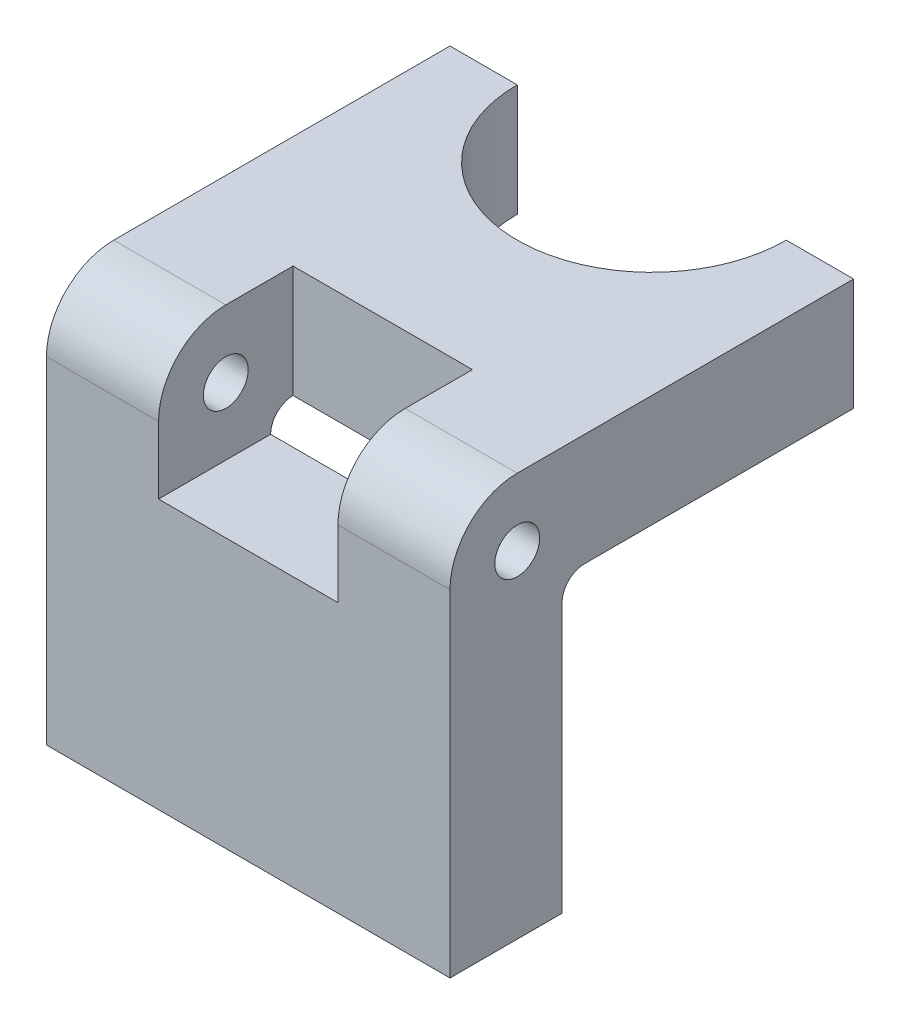
ISO-10303-21;
HEADER;
FILE_DESCRIPTION(('STEP AP214'),'2;1');
FILE_NAME('part.step','',(''),(''),'','','');
FILE_SCHEMA(('AUTOMOTIVE_DESIGN { 1 0 10303 214 1 1 1 1 }'));
ENDSEC;
DATA;
#1=APPLICATION_CONTEXT('core data for automotive mechanical design processes');
#2=APPLICATION_PROTOCOL_DEFINITION('international standard','automotive_design',2000,#1);
#3=PRODUCT_CONTEXT('',#1,'mechanical');
#4=PRODUCT('Part','Part','',(#3));
#5=PRODUCT_RELATED_PRODUCT_CATEGORY('part','',(#4));
#6=PRODUCT_DEFINITION_FORMATION('','',#4);
#7=PRODUCT_DEFINITION_CONTEXT('part definition',#1,'design');
#8=PRODUCT_DEFINITION('design','',#6,#7);
#9=PRODUCT_DEFINITION_SHAPE('','',#8);
#10=(LENGTH_UNIT() NAMED_UNIT(*) SI_UNIT(.MILLI.,.METRE.));
#11=(NAMED_UNIT(*) PLANE_ANGLE_UNIT() SI_UNIT($,.RADIAN.));
#12=(NAMED_UNIT(*) SI_UNIT($,.STERADIAN.) SOLID_ANGLE_UNIT());
#13=UNCERTAINTY_MEASURE_WITH_UNIT(LENGTH_MEASURE(1.E-05),#10,'distance_accuracy_value','');
#14=(GEOMETRIC_REPRESENTATION_CONTEXT(3) GLOBAL_UNCERTAINTY_ASSIGNED_CONTEXT((#13)) GLOBAL_UNIT_ASSIGNED_CONTEXT((#10,
#11,#12)) REPRESENTATION_CONTEXT('',''));
#15=CARTESIAN_POINT('',(0.,0.,0.));
#16=DIRECTION('',(0.,0.,1.));
#17=DIRECTION('',(1.,0.,0.));
#18=AXIS2_PLACEMENT_3D('',#15,#16,#17);
#19=CARTESIAN_POINT('',(57.15,13.7165047081966,0.));
#20=DIRECTION('',(0.,1.,0.));
#21=DIRECTION('',(0.,0.,1.));
#22=AXIS2_PLACEMENT_3D('',#19,#20,#21);
#23=PLANE('',#22);
#24=DIRECTION('',(-1.,0.,0.));
#25=VECTOR('',#24,1.);
#26=CARTESIAN_POINT('',(57.15,13.7165047081966,1.91264037979371));
#27=LINE('',#26,#25);
#28=CARTESIAN_POINT('',(15.875,13.7165047081966,1.91264037979371));
#29=VERTEX_POINT('',#28);
#30=CARTESIAN_POINT('',(0.,13.7165047081966,1.91264037979371));
#31=VERTEX_POINT('',#30);
#32=EDGE_CURVE('E50',#29,#31,#27,.T.);
#33=ORIENTED_EDGE('',*,*,#32,.F.);
#34=DIRECTION('',(0.,0.,-1.));
#35=VECTOR('',#34,1.);
#36=CARTESIAN_POINT('',(15.875,13.7165047081966,0.));
#37=LINE('',#36,#35);
#38=CARTESIAN_POINT('',(15.875,13.7165047081966,-7.61235962020625));
#39=VERTEX_POINT('',#38);
#40=EDGE_CURVE('E155',#29,#39,#37,.T.);
#41=ORIENTED_EDGE('',*,*,#40,.T.);
#42=DIRECTION('',(1.,0.,0.));
#43=VECTOR('',#42,1.);
#44=CARTESIAN_POINT('',(15.875,13.7165047081966,-7.61235962020625));
#45=LINE('',#44,#43);
#46=CARTESIAN_POINT('',(41.275,13.7165047081966,-7.61235962020625));
#47=VERTEX_POINT('',#46);
#48=EDGE_CURVE('E290',#39,#47,#45,.T.);
#49=ORIENTED_EDGE('',*,*,#48,.T.);
#50=DIRECTION('',(0.,0.,-1.));
#51=VECTOR('',#50,1.);
#52=CARTESIAN_POINT('',(41.275,13.7165047081966,0.));
#53=LINE('',#52,#51);
#54=CARTESIAN_POINT('',(41.275,13.7165047081966,1.91264037979371));
#55=VERTEX_POINT('',#54);
#56=EDGE_CURVE('E316',#55,#47,#53,.T.);
#57=ORIENTED_EDGE('',*,*,#56,.F.);
#58=CARTESIAN_POINT('',(57.15,13.7165047081966,1.91264037979371));
#59=VERTEX_POINT('',#58);
#60=EDGE_CURVE('E11',#59,#55,#27,.T.);
#61=ORIENTED_EDGE('',*,*,#60,.F.);
#62=DIRECTION('',(0.,0.,-1.));
#63=VECTOR('',#62,1.);
#64=CARTESIAN_POINT('',(57.15,13.7165047081966,0.));
#65=LINE('',#64,#63);
#66=CARTESIAN_POINT('',(57.15,13.7165047081966,-45.7123596202062));
#67=VERTEX_POINT('',#66);
#68=EDGE_CURVE('E216',#59,#67,#65,.T.);
#69=ORIENTED_EDGE('',*,*,#68,.T.);
#70=DIRECTION('',(-1.,0.,0.));
#71=VECTOR('',#70,1.);
#72=CARTESIAN_POINT('',(57.15,13.7165047081966,-45.7123596202062));
#73=LINE('',#72,#71);
#74=CARTESIAN_POINT('',(47.625,13.7165047081966,-45.7123596202062));
#75=VERTEX_POINT('',#74);
#76=EDGE_CURVE('E207',#67,#75,#73,.T.);
#77=ORIENTED_EDGE('',*,*,#76,.T.);
#78=CARTESIAN_POINT('',(28.575,13.7165047081966,-45.7123596202062));
#79=DIRECTION('',(0.,1.,0.));
#80=DIRECTION('',(0.,0.,1.));
#81=AXIS2_PLACEMENT_3D('',#78,#79,#80);
#82=CIRCLE('',#81,19.05);
#83=CARTESIAN_POINT('',(9.52499999999999,13.7165047081966,-45.7123596202062));
#84=VERTEX_POINT('',#83);
#85=EDGE_CURVE('E279',#84,#75,#82,.T.);
#86=ORIENTED_EDGE('',*,*,#85,.F.);
#87=CARTESIAN_POINT('',(0.,13.7165047081966,-45.7123596202062));
#88=VERTEX_POINT('',#87);
#89=EDGE_CURVE('E211',#84,#88,#73,.T.);
#90=ORIENTED_EDGE('',*,*,#89,.T.);
#91=DIRECTION('',(0.,0.,-1.));
#92=VECTOR('',#91,1.);
#93=CARTESIAN_POINT('',(0.,13.7165047081966,0.));
#94=LINE('',#93,#92);
#95=EDGE_CURVE('E181',#31,#88,#94,.T.);
#96=ORIENTED_EDGE('',*,*,#95,.F.);
#97=EDGE_LOOP('',(#33,#41,#49,#57,#61,#69,#77,#86,#90,#96));
#98=FACE_BOUND('',#97,.T.);
#99=ADVANCED_FACE('F42',(#98),#23,.T.);
#100=CARTESIAN_POINT('',(57.15,4.19150470819657,1.91264037979378));
#101=DIRECTION('',(-1.,0.,0.));
#102=DIRECTION('',(0.,0.,1.));
#103=AXIS2_PLACEMENT_3D('',#100,#101,#102);
#104=CYLINDRICAL_SURFACE('',#103,9.525);
#105=CARTESIAN_POINT('',(15.875,4.19150470819657,1.91264037979378));
#106=DIRECTION('',(1.,0.,0.));
#107=DIRECTION('',(0.,0.,-1.));
#108=AXIS2_PLACEMENT_3D('',#105,#106,#107);
#109=CIRCLE('',#108,9.525);
#110=CARTESIAN_POINT('',(15.875,4.1915047081965,11.4376403797938));
#111=VERTEX_POINT('',#110);
#112=EDGE_CURVE('E159',#29,#111,#109,.T.);
#113=ORIENTED_EDGE('',*,*,#112,.F.);
#114=ORIENTED_EDGE('',*,*,#32,.T.);
#115=CARTESIAN_POINT('',(0.,4.19150470819657,1.91264037979378));
#116=DIRECTION('',(1.,0.,0.));
#117=DIRECTION('',(0.,0.,-1.));
#118=AXIS2_PLACEMENT_3D('',#115,#116,#117);
#119=CIRCLE('',#118,9.525);
#120=CARTESIAN_POINT('',(0.,4.1915047081965,11.4376403797938));
#121=VERTEX_POINT('',#120);
#122=EDGE_CURVE('E231',#31,#121,#119,.T.);
#123=ORIENTED_EDGE('',*,*,#122,.T.);
#124=DIRECTION('',(-1.,0.,0.));
#125=VECTOR('',#124,1.);
#126=CARTESIAN_POINT('',(57.15,4.1915047081965,11.4376403797938));
#127=LINE('',#126,#125);
#128=EDGE_CURVE('E175',#111,#121,#127,.T.);
#129=ORIENTED_EDGE('',*,*,#128,.F.);
#130=EDGE_LOOP('',(#113,#114,#123,#129));
#131=FACE_BOUND('',#130,.T.);
#132=ADVANCED_FACE('F172',(#131),#104,.T.);
#133=CARTESIAN_POINT('',(57.15,0.,11.4376403797938));
#134=DIRECTION('',(0.,0.,-1.));
#135=DIRECTION('',(0.,1.,0.));
#136=AXIS2_PLACEMENT_3D('',#133,#134,#135);
#137=PLANE('',#136);
#138=DIRECTION('',(0.,1.,0.));
#139=VECTOR('',#138,1.);
#140=CARTESIAN_POINT('',(15.875,0.,11.4376403797938));
#141=LINE('',#140,#139);
#142=CARTESIAN_POINT('',(15.875,-5.33349529180345,11.4376403797938));
#143=VERTEX_POINT('',#142);
#144=EDGE_CURVE('E177',#143,#111,#141,.T.);
#145=ORIENTED_EDGE('',*,*,#144,.T.);
#146=ORIENTED_EDGE('',*,*,#128,.T.);
#147=DIRECTION('',(0.,-1.,0.));
#148=VECTOR('',#147,1.);
#149=CARTESIAN_POINT('',(0.,0.,11.4376403797938));
#150=LINE('',#149,#148);
#151=CARTESIAN_POINT('',(0.,-43.4334952918034,11.4376403797938));
#152=VERTEX_POINT('',#151);
#153=EDGE_CURVE('E228',#121,#152,#150,.T.);
#154=ORIENTED_EDGE('',*,*,#153,.T.);
#155=DIRECTION('',(-1.,0.,0.));
#156=VECTOR('',#155,1.);
#157=CARTESIAN_POINT('',(57.15,-43.4334952918034,11.4376403797938));
#158=LINE('',#157,#156);
#159=CARTESIAN_POINT('',(57.15,-43.4334952918034,11.4376403797938));
#160=VERTEX_POINT('',#159);
#161=EDGE_CURVE('E193',#160,#152,#158,.T.);
#162=ORIENTED_EDGE('',*,*,#161,.F.);
#163=DIRECTION('',(0.,-1.,0.));
#164=VECTOR('',#163,1.);
#165=CARTESIAN_POINT('',(57.15,0.,11.4376403797938));
#166=LINE('',#165,#164);
#167=CARTESIAN_POINT('',(57.15,4.1915047081965,11.4376403797938));
#168=VERTEX_POINT('',#167);
#169=EDGE_CURVE('E251',#168,#160,#166,.T.);
#170=ORIENTED_EDGE('',*,*,#169,.F.);
#171=CARTESIAN_POINT('',(41.275,4.1915047081965,11.4376403797938));
#172=VERTEX_POINT('',#171);
#173=EDGE_CURVE('E183',#168,#172,#127,.T.);
#174=ORIENTED_EDGE('',*,*,#173,.T.);
#175=DIRECTION('',(0.,1.,0.));
#176=VECTOR('',#175,1.);
#177=CARTESIAN_POINT('',(41.275,0.,11.4376403797938));
#178=LINE('',#177,#176);
#179=CARTESIAN_POINT('',(41.275,-5.33349529180345,11.4376403797938));
#180=VERTEX_POINT('',#179);
#181=EDGE_CURVE('E309',#180,#172,#178,.T.);
#182=ORIENTED_EDGE('',*,*,#181,.F.);
#183=DIRECTION('',(1.,0.,0.));
#184=VECTOR('',#183,1.);
#185=CARTESIAN_POINT('',(15.875,-5.33349529180345,11.4376403797938));
#186=LINE('',#185,#184);
#187=EDGE_CURVE('E57',#143,#180,#186,.T.);
#188=ORIENTED_EDGE('',*,*,#187,.F.);
#189=EDGE_LOOP('',(#145,#146,#154,#162,#170,#174,#182,#188));
#190=FACE_BOUND('',#189,.T.);
#191=ADVANCED_FACE('F367',(#190),#137,.F.);
#192=CARTESIAN_POINT('',(57.15,-5.33349529180343,-7.61235962020622));
#193=DIRECTION('',(-1.,0.,0.));
#194=DIRECTION('',(0.,0.,1.));
#195=AXIS2_PLACEMENT_3D('',#192,#193,#194);
#196=CYLINDRICAL_SURFACE('',#195,3.175);
#197=DIRECTION('',(-1.,0.,0.));
#198=VECTOR('',#197,1.);
#199=CARTESIAN_POINT('',(57.15,-2.15849529180343,-7.61235962020625));
#200=LINE('',#199,#198);
#201=CARTESIAN_POINT('',(15.875,-2.15849529180343,-7.61235962020625));
#202=VERTEX_POINT('',#201);
#203=CARTESIAN_POINT('',(0.,-2.15849529180343,-7.61235962020625));
#204=VERTEX_POINT('',#203);
#205=EDGE_CURVE('E264',#202,#204,#200,.T.);
#206=ORIENTED_EDGE('',*,*,#205,.F.);
#207=CARTESIAN_POINT('',(15.875,-5.33349529180343,-7.61235962020622));
#208=DIRECTION('',(1.,0.,0.));
#209=DIRECTION('',(0.,0.,-1.));
#210=AXIS2_PLACEMENT_3D('',#207,#208,#209);
#211=CIRCLE('',#210,3.175);
#212=CARTESIAN_POINT('',(15.875,-5.33349529180345,-4.43735962020622));
#213=VERTEX_POINT('',#212);
#214=EDGE_CURVE('E323',#202,#213,#211,.T.);
#215=ORIENTED_EDGE('',*,*,#214,.T.);
#216=DIRECTION('',(-1.,0.,0.));
#217=VECTOR('',#216,1.);
#218=CARTESIAN_POINT('',(57.15,-5.33349529180345,-4.43735962020622));
#219=LINE('',#218,#217);
#220=CARTESIAN_POINT('',(0.,-5.33349529180345,-4.43735962020622));
#221=VERTEX_POINT('',#220);
#222=EDGE_CURVE('E265',#213,#221,#219,.T.);
#223=ORIENTED_EDGE('',*,*,#222,.T.);
#224=CARTESIAN_POINT('',(0.,-5.33349529180343,-7.61235962020622));
#225=DIRECTION('',(1.,0.,0.));
#226=DIRECTION('',(0.,0.,-1.));
#227=AXIS2_PLACEMENT_3D('',#224,#225,#226);
#228=CIRCLE('',#227,3.175);
#229=EDGE_CURVE('E269',#204,#221,#228,.T.);
#230=ORIENTED_EDGE('',*,*,#229,.F.);
#231=EDGE_LOOP('',(#206,#215,#223,#230));
#232=FACE_BOUND('',#231,.T.);
#233=ADVANCED_FACE('F372',(#232),#196,.F.);
#234=CARTESIAN_POINT('',(57.15,0.,-45.7123596202062));
#235=DIRECTION('',(0.,0.,-1.));
#236=DIRECTION('',(0.,1.,0.));
#237=AXIS2_PLACEMENT_3D('',#234,#235,#236);
#238=PLANE('',#237);
#239=DIRECTION('',(0.,1.,0.));
#240=VECTOR('',#239,1.);
#241=CARTESIAN_POINT('',(9.52499999999999,-43.4344952918034,-45.7123596202062));
#242=LINE('',#241,#240);
#243=CARTESIAN_POINT('',(9.52499999999999,-2.15849529180343,-45.7123596202062));
#244=VERTEX_POINT('',#243);
#245=EDGE_CURVE('E282',#84,#244,#242,.F.);
#246=ORIENTED_EDGE('',*,*,#245,.T.);
#247=DIRECTION('',(-1.,0.,0.));
#248=VECTOR('',#247,1.);
#249=CARTESIAN_POINT('',(57.15,-2.15849529180343,-45.7123596202062));
#250=LINE('',#249,#248);
#251=CARTESIAN_POINT('',(0.,-2.15849529180343,-45.7123596202062));
#252=VERTEX_POINT('',#251);
#253=EDGE_CURVE('E206',#244,#252,#250,.T.);
#254=ORIENTED_EDGE('',*,*,#253,.T.);
#255=DIRECTION('',(0.,-1.,0.));
#256=VECTOR('',#255,1.);
#257=CARTESIAN_POINT('',(0.,0.,-45.7123596202062));
#258=LINE('',#257,#256);
#259=EDGE_CURVE('E212',#88,#252,#258,.T.);
#260=ORIENTED_EDGE('',*,*,#259,.F.);
#261=ORIENTED_EDGE('',*,*,#89,.F.);
#262=EDGE_LOOP('',(#246,#254,#260,#261));
#263=FACE_BOUND('',#262,.T.);
#264=ADVANCED_FACE('F458',(#263),#238,.T.);
#265=CARTESIAN_POINT('',(57.15,0.,-4.43735962020622));
#266=DIRECTION('',(0.,0.,-1.));
#267=DIRECTION('',(0.,1.,0.));
#268=AXIS2_PLACEMENT_3D('',#265,#266,#267);
#269=PLANE('',#268);
#270=DIRECTION('',(0.,-1.,0.));
#271=VECTOR('',#270,1.);
#272=CARTESIAN_POINT('',(0.,0.,-4.43735962020622));
#273=LINE('',#272,#271);
#274=CARTESIAN_POINT('',(0.,-43.4334952918034,-4.43735962020623));
#275=VERTEX_POINT('',#274);
#276=EDGE_CURVE('E221',#221,#275,#273,.T.);
#277=ORIENTED_EDGE('',*,*,#276,.F.);
#278=ORIENTED_EDGE('',*,*,#222,.F.);
#279=DIRECTION('',(1.,0.,0.));
#280=VECTOR('',#279,1.);
#281=CARTESIAN_POINT('',(15.875,-5.33349529180345,-4.43735962020622));
#282=LINE('',#281,#280);
#283=CARTESIAN_POINT('',(41.275,-5.33349529180345,-4.43735962020622));
#284=VERTEX_POINT('',#283);
#285=EDGE_CURVE('E293',#213,#284,#282,.T.);
#286=ORIENTED_EDGE('',*,*,#285,.T.);
#287=CARTESIAN_POINT('',(57.15,-5.33349529180345,-4.43735962020622));
#288=VERTEX_POINT('',#287);
#289=EDGE_CURVE('E260',#288,#284,#219,.T.);
#290=ORIENTED_EDGE('',*,*,#289,.F.);
#291=DIRECTION('',(0.,-1.,0.));
#292=VECTOR('',#291,1.);
#293=CARTESIAN_POINT('',(57.15,0.,-4.43735962020622));
#294=LINE('',#293,#292);
#295=CARTESIAN_POINT('',(57.15,-43.4334952918034,-4.43735962020623));
#296=VERTEX_POINT('',#295);
#297=EDGE_CURVE('E244',#288,#296,#294,.T.);
#298=ORIENTED_EDGE('',*,*,#297,.T.);
#299=DIRECTION('',(-1.,0.,0.));
#300=VECTOR('',#299,1.);
#301=CARTESIAN_POINT('',(57.15,-43.4334952918034,-4.43735962020623));
#302=LINE('',#301,#300);
#303=EDGE_CURVE('E198',#296,#275,#302,.T.);
#304=ORIENTED_EDGE('',*,*,#303,.T.);
#305=EDGE_LOOP('',(#277,#278,#286,#290,#298,#304));
#306=FACE_BOUND('',#305,.T.);
#307=ADVANCED_FACE('F385',(#306),#269,.T.);
#308=CARTESIAN_POINT('',(57.15,-2.15849529180343,0.));
#309=DIRECTION('',(0.,1.,0.));
#310=DIRECTION('',(0.,0.,1.));
#311=AXIS2_PLACEMENT_3D('',#308,#309,#310);
#312=PLANE('',#311);
#313=ORIENTED_EDGE('',*,*,#253,.F.);
#314=CARTESIAN_POINT('',(28.575,-2.15849529180343,-45.7123596202062));
#315=DIRECTION('',(0.,1.,0.));
#316=DIRECTION('',(0.,0.,1.));
#317=AXIS2_PLACEMENT_3D('',#314,#315,#316);
#318=CIRCLE('',#317,19.05);
#319=CARTESIAN_POINT('',(47.625,-2.15849529180343,-45.7123596202062));
#320=VERTEX_POINT('',#319);
#321=EDGE_CURVE('E274',#320,#244,#318,.F.);
#322=ORIENTED_EDGE('',*,*,#321,.F.);
#323=CARTESIAN_POINT('',(57.15,-2.15849529180343,-45.7123596202062));
#324=VERTEX_POINT('',#323);
#325=EDGE_CURVE('E202',#324,#320,#250,.T.);
#326=ORIENTED_EDGE('',*,*,#325,.F.);
#327=DIRECTION('',(0.,0.,-1.));
#328=VECTOR('',#327,1.);
#329=CARTESIAN_POINT('',(57.15,-2.15849529180343,0.));
#330=LINE('',#329,#328);
#331=CARTESIAN_POINT('',(57.15,-2.15849529180343,-7.61235962020625));
#332=VERTEX_POINT('',#331);
#333=EDGE_CURVE('E241',#332,#324,#330,.T.);
#334=ORIENTED_EDGE('',*,*,#333,.F.);
#335=CARTESIAN_POINT('',(41.275,-2.15849529180343,-7.61235962020625));
#336=VERTEX_POINT('',#335);
#337=EDGE_CURVE('E236',#332,#336,#200,.T.);
#338=ORIENTED_EDGE('',*,*,#337,.T.);
#339=DIRECTION('',(1.,0.,0.));
#340=VECTOR('',#339,1.);
#341=CARTESIAN_POINT('',(15.875,-2.15849529180343,-7.61235962020625));
#342=LINE('',#341,#340);
#343=EDGE_CURVE('E65',#202,#336,#342,.T.);
#344=ORIENTED_EDGE('',*,*,#343,.F.);
#345=ORIENTED_EDGE('',*,*,#205,.T.);
#346=DIRECTION('',(0.,0.,-1.));
#347=VECTOR('',#346,1.);
#348=CARTESIAN_POINT('',(0.,-2.15849529180343,0.));
#349=LINE('',#348,#347);
#350=EDGE_CURVE('E217',#204,#252,#349,.T.);
#351=ORIENTED_EDGE('',*,*,#350,.T.);
#352=EDGE_LOOP('',(#313,#322,#326,#334,#338,#344,#345,#351));
#353=FACE_BOUND('',#352,.T.);
#354=ADVANCED_FACE('F376',(#353),#312,.F.);
#355=ORIENTED_EDGE('',*,*,#60,.T.);
#356=CARTESIAN_POINT('',(41.275,4.19150470819657,1.91264037979378));
#357=DIRECTION('',(1.,0.,0.));
#358=DIRECTION('',(0.,0.,-1.));
#359=AXIS2_PLACEMENT_3D('',#356,#357,#358);
#360=CIRCLE('',#359,9.525);
#361=EDGE_CURVE('E312',#55,#172,#360,.T.);
#362=ORIENTED_EDGE('',*,*,#361,.T.);
#363=ORIENTED_EDGE('',*,*,#173,.F.);
#364=CARTESIAN_POINT('',(57.15,4.19150470819657,1.91264037979378));
#365=DIRECTION('',(1.,0.,0.));
#366=DIRECTION('',(0.,0.,-1.));
#367=AXIS2_PLACEMENT_3D('',#364,#365,#366);
#368=CIRCLE('',#367,9.525);
#369=EDGE_CURVE('E254',#59,#168,#368,.T.);
#370=ORIENTED_EDGE('',*,*,#369,.F.);
#371=EDGE_LOOP('',(#355,#362,#363,#370));
#372=FACE_BOUND('',#371,.T.);
#373=ADVANCED_FACE('F368',(#372),#104,.T.);
#374=CARTESIAN_POINT('',(57.15,-43.4334952918034,0.));
#375=DIRECTION('',(0.,1.,0.));
#376=DIRECTION('',(0.,0.,1.));
#377=AXIS2_PLACEMENT_3D('',#374,#375,#376);
#378=PLANE('',#377);
#379=DIRECTION('',(0.,0.,-1.));
#380=VECTOR('',#379,1.);
#381=CARTESIAN_POINT('',(0.,-43.4334952918034,0.));
#382=LINE('',#381,#380);
#383=EDGE_CURVE('E224',#152,#275,#382,.T.);
#384=ORIENTED_EDGE('',*,*,#383,.T.);
#385=ORIENTED_EDGE('',*,*,#303,.F.);
#386=DIRECTION('',(0.,0.,-1.));
#387=VECTOR('',#386,1.);
#388=CARTESIAN_POINT('',(57.15,-43.4334952918034,0.));
#389=LINE('',#388,#387);
#390=EDGE_CURVE('E247',#160,#296,#389,.T.);
#391=ORIENTED_EDGE('',*,*,#390,.F.);
#392=ORIENTED_EDGE('',*,*,#161,.T.);
#393=EDGE_LOOP('',(#384,#385,#391,#392));
#394=FACE_BOUND('',#393,.T.);
#395=ADVANCED_FACE('F375',(#394),#378,.F.);
#396=DIRECTION('',(0.,1.,0.));
#397=VECTOR('',#396,1.);
#398=CARTESIAN_POINT('',(47.625,-43.4344952918034,-45.7123596202062));
#399=LINE('',#398,#397);
#400=EDGE_CURVE('E286',#320,#75,#399,.T.);
#401=ORIENTED_EDGE('',*,*,#400,.T.);
#402=ORIENTED_EDGE('',*,*,#76,.F.);
#403=DIRECTION('',(0.,-1.,0.));
#404=VECTOR('',#403,1.);
#405=CARTESIAN_POINT('',(57.15,0.,-45.7123596202062));
#406=LINE('',#405,#404);
#407=EDGE_CURVE('E237',#67,#324,#406,.T.);
#408=ORIENTED_EDGE('',*,*,#407,.T.);
#409=ORIENTED_EDGE('',*,*,#325,.T.);
#410=EDGE_LOOP('',(#401,#402,#408,#409));
#411=FACE_BOUND('',#410,.T.);
#412=ADVANCED_FACE('F382',(#411),#238,.T.);
#413=CARTESIAN_POINT('',(57.15,0.,0.));
#414=DIRECTION('',(1.,0.,0.));
#415=DIRECTION('',(0.,0.,-1.));
#416=AXIS2_PLACEMENT_3D('',#413,#414,#415);
#417=PLANE('',#416);
#418=CARTESIAN_POINT('',(57.15,4.19150470819657,1.91264037979378));
#419=DIRECTION('',(1.,0.,0.));
#420=DIRECTION('',(0.,0.,-1.));
#421=AXIS2_PLACEMENT_3D('',#418,#419,#420);
#422=CIRCLE('',#421,3.175);
#423=CARTESIAN_POINT('',(57.15,4.19150470819657,-1.26235962020622));
#424=VERTEX_POINT('',#423);
#425=EDGE_CURVE('E340',#424,#424,#422,.T.);
#426=ORIENTED_EDGE('',*,*,#425,.F.);
#427=EDGE_LOOP('',(#426));
#428=FACE_BOUND('',#427,.T.);
#429=CARTESIAN_POINT('',(57.15,-5.33349529180343,-7.61235962020622));
#430=DIRECTION('',(1.,0.,0.));
#431=DIRECTION('',(0.,0.,-1.));
#432=AXIS2_PLACEMENT_3D('',#429,#430,#431);
#433=CIRCLE('',#432,3.175);
#434=EDGE_CURVE('E273',#332,#288,#433,.T.);
#435=ORIENTED_EDGE('',*,*,#434,.F.);
#436=ORIENTED_EDGE('',*,*,#333,.T.);
#437=ORIENTED_EDGE('',*,*,#407,.F.);
#438=ORIENTED_EDGE('',*,*,#68,.F.);
#439=ORIENTED_EDGE('',*,*,#369,.T.);
#440=ORIENTED_EDGE('',*,*,#169,.T.);
#441=ORIENTED_EDGE('',*,*,#390,.T.);
#442=ORIENTED_EDGE('',*,*,#297,.F.);
#443=EDGE_LOOP('',(#435,#436,#437,#438,#439,#440,#441,#442));
#444=FACE_BOUND('',#443,.T.);
#445=ADVANCED_FACE('F470',(#428,#444),#417,.T.);
#446=CARTESIAN_POINT('',(0.,0.,0.));
#447=DIRECTION('',(1.,0.,0.));
#448=DIRECTION('',(0.,0.,-1.));
#449=AXIS2_PLACEMENT_3D('',#446,#447,#448);
#450=PLANE('',#449);
#451=CARTESIAN_POINT('',(0.,4.19150470819657,1.91264037979378));
#452=DIRECTION('',(1.,0.,0.));
#453=DIRECTION('',(0.,0.,-1.));
#454=AXIS2_PLACEMENT_3D('',#451,#452,#453);
#455=CIRCLE('',#454,3.175);
#456=CARTESIAN_POINT('',(0.,4.19150470819657,-1.26235962020622));
#457=VERTEX_POINT('',#456);
#458=EDGE_CURVE('E339',#457,#457,#455,.T.);
#459=ORIENTED_EDGE('',*,*,#458,.T.);
#460=EDGE_LOOP('',(#459));
#461=FACE_BOUND('',#460,.T.);
#462=ORIENTED_EDGE('',*,*,#350,.F.);
#463=ORIENTED_EDGE('',*,*,#229,.T.);
#464=ORIENTED_EDGE('',*,*,#276,.T.);
#465=ORIENTED_EDGE('',*,*,#383,.F.);
#466=ORIENTED_EDGE('',*,*,#153,.F.);
#467=ORIENTED_EDGE('',*,*,#122,.F.);
#468=ORIENTED_EDGE('',*,*,#95,.T.);
#469=ORIENTED_EDGE('',*,*,#259,.T.);
#470=EDGE_LOOP('',(#462,#463,#464,#465,#466,#467,#468,#469));
#471=FACE_BOUND('',#470,.T.);
#472=ADVANCED_FACE('F349',(#461,#471),#450,.F.);
#473=CARTESIAN_POINT('',(41.275,-5.33349529180343,-7.61235962020622));
#474=DIRECTION('',(1.,0.,0.));
#475=DIRECTION('',(0.,0.,-1.));
#476=AXIS2_PLACEMENT_3D('',#473,#474,#475);
#477=CIRCLE('',#476,3.175);
#478=EDGE_CURVE('E303',#336,#284,#477,.T.);
#479=ORIENTED_EDGE('',*,*,#478,.F.);
#480=ORIENTED_EDGE('',*,*,#337,.F.);
#481=ORIENTED_EDGE('',*,*,#434,.T.);
#482=ORIENTED_EDGE('',*,*,#289,.T.);
#483=EDGE_LOOP('',(#479,#480,#481,#482));
#484=FACE_BOUND('',#483,.T.);
#485=ADVANCED_FACE('F478',(#484),#196,.F.);
#486=CARTESIAN_POINT('',(28.575,-43.4344952918034,-45.7123596202062));
#487=DIRECTION('',(0.,1.,0.));
#488=DIRECTION('',(0.,0.,1.));
#489=AXIS2_PLACEMENT_3D('',#486,#487,#488);
#490=CYLINDRICAL_SURFACE('',#489,19.05);
#491=ORIENTED_EDGE('',*,*,#85,.T.);
#492=ORIENTED_EDGE('',*,*,#400,.F.);
#493=ORIENTED_EDGE('',*,*,#321,.T.);
#494=ORIENTED_EDGE('',*,*,#245,.F.);
#495=EDGE_LOOP('',(#491,#492,#493,#494));
#496=FACE_BOUND('',#495,.T.);
#497=ADVANCED_FACE('F476',(#496),#490,.F.);
#498=CARTESIAN_POINT('',(15.875,0.,-7.61235962020625));
#499=DIRECTION('',(0.,0.,1.));
#500=DIRECTION('',(0.,-1.,0.));
#501=AXIS2_PLACEMENT_3D('',#498,#499,#500);
#502=PLANE('',#501);
#503=DIRECTION('',(0.,-1.,0.));
#504=VECTOR('',#503,1.);
#505=CARTESIAN_POINT('',(41.275,0.,-7.61235962020625));
#506=LINE('',#505,#504);
#507=EDGE_CURVE('E168',#47,#336,#506,.T.);
#508=ORIENTED_EDGE('',*,*,#507,.F.);
#509=ORIENTED_EDGE('',*,*,#48,.F.);
#510=DIRECTION('',(0.,-1.,0.));
#511=VECTOR('',#510,1.);
#512=CARTESIAN_POINT('',(15.875,0.,-7.61235962020625));
#513=LINE('',#512,#511);
#514=EDGE_CURVE('E162',#39,#202,#513,.T.);
#515=ORIENTED_EDGE('',*,*,#514,.T.);
#516=ORIENTED_EDGE('',*,*,#343,.T.);
#517=EDGE_LOOP('',(#508,#509,#515,#516));
#518=FACE_BOUND('',#517,.T.);
#519=ADVANCED_FACE('F481',(#518),#502,.T.);
#520=CARTESIAN_POINT('',(15.875,-5.33349529180345,0.));
#521=DIRECTION('',(0.,1.,0.));
#522=DIRECTION('',(0.,0.,1.));
#523=AXIS2_PLACEMENT_3D('',#520,#521,#522);
#524=PLANE('',#523);
#525=DIRECTION('',(0.,0.,1.));
#526=VECTOR('',#525,1.);
#527=CARTESIAN_POINT('',(41.275,-5.33349529180345,0.));
#528=LINE('',#527,#526);
#529=EDGE_CURVE('E306',#284,#180,#528,.T.);
#530=ORIENTED_EDGE('',*,*,#529,.F.);
#531=ORIENTED_EDGE('',*,*,#285,.F.);
#532=DIRECTION('',(0.,0.,1.));
#533=VECTOR('',#532,1.);
#534=CARTESIAN_POINT('',(15.875,-5.33349529180345,0.));
#535=LINE('',#534,#533);
#536=EDGE_CURVE('E327',#213,#143,#535,.T.);
#537=ORIENTED_EDGE('',*,*,#536,.T.);
#538=ORIENTED_EDGE('',*,*,#187,.T.);
#539=EDGE_LOOP('',(#530,#531,#537,#538));
#540=FACE_BOUND('',#539,.T.);
#541=ADVANCED_FACE('F479',(#540),#524,.T.);
#542=CARTESIAN_POINT('',(15.875,0.,0.));
#543=DIRECTION('',(1.,0.,0.));
#544=DIRECTION('',(0.,0.,-1.));
#545=AXIS2_PLACEMENT_3D('',#542,#543,#544);
#546=PLANE('',#545);
#547=CARTESIAN_POINT('',(15.875,4.19150470819657,1.91264037979378));
#548=DIRECTION('',(1.,0.,0.));
#549=DIRECTION('',(0.,0.,-1.));
#550=AXIS2_PLACEMENT_3D('',#547,#548,#549);
#551=CIRCLE('',#550,3.175);
#552=CARTESIAN_POINT('',(15.875,4.19150470819657,-1.26235962020622));
#553=VERTEX_POINT('',#552);
#554=EDGE_CURVE('E320',#553,#553,#551,.T.);
#555=ORIENTED_EDGE('',*,*,#554,.F.);
#556=EDGE_LOOP('',(#555));
#557=FACE_BOUND('',#556,.T.);
#558=ORIENTED_EDGE('',*,*,#40,.F.);
#559=ORIENTED_EDGE('',*,*,#112,.T.);
#560=ORIENTED_EDGE('',*,*,#144,.F.);
#561=ORIENTED_EDGE('',*,*,#536,.F.);
#562=ORIENTED_EDGE('',*,*,#214,.F.);
#563=ORIENTED_EDGE('',*,*,#514,.F.);
#564=EDGE_LOOP('',(#558,#559,#560,#561,#562,#563));
#565=FACE_BOUND('',#564,.T.);
#566=ADVANCED_FACE('F157',(#557,#565),#546,.T.);
#567=CARTESIAN_POINT('',(41.275,0.,0.));
#568=DIRECTION('',(1.,0.,0.));
#569=DIRECTION('',(0.,0.,-1.));
#570=AXIS2_PLACEMENT_3D('',#567,#568,#569);
#571=PLANE('',#570);
#572=CARTESIAN_POINT('',(41.275,4.19150470819657,1.91264037979378));
#573=DIRECTION('',(1.,0.,0.));
#574=DIRECTION('',(0.,0.,-1.));
#575=AXIS2_PLACEMENT_3D('',#572,#573,#574);
#576=CIRCLE('',#575,3.175);
#577=CARTESIAN_POINT('',(41.275,4.19150470819657,-1.26235962020622));
#578=VERTEX_POINT('',#577);
#579=EDGE_CURVE('E335',#578,#578,#576,.T.);
#580=ORIENTED_EDGE('',*,*,#579,.T.);
#581=EDGE_LOOP('',(#580));
#582=FACE_BOUND('',#581,.T.);
#583=ORIENTED_EDGE('',*,*,#56,.T.);
#584=ORIENTED_EDGE('',*,*,#507,.T.);
#585=ORIENTED_EDGE('',*,*,#478,.T.);
#586=ORIENTED_EDGE('',*,*,#529,.T.);
#587=ORIENTED_EDGE('',*,*,#181,.T.);
#588=ORIENTED_EDGE('',*,*,#361,.F.);
#589=EDGE_LOOP('',(#583,#584,#585,#586,#587,#588));
#590=FACE_BOUND('',#589,.T.);
#591=ADVANCED_FACE('F360',(#582,#590),#571,.F.);
#592=CARTESIAN_POINT('',(0.,4.19150470819657,1.91264037979378));
#593=DIRECTION('',(1.,0.,0.));
#594=DIRECTION('',(0.,0.,-1.));
#595=AXIS2_PLACEMENT_3D('',#592,#593,#594);
#596=CYLINDRICAL_SURFACE('',#595,3.175);
#597=ORIENTED_EDGE('',*,*,#425,.T.);
#598=EDGE_LOOP('',(#597));
#599=FACE_BOUND('',#598,.T.);
#600=ORIENTED_EDGE('',*,*,#579,.F.);
#601=EDGE_LOOP('',(#600));
#602=FACE_BOUND('',#601,.T.);
#603=ADVANCED_FACE('F354',(#599,#602),#596,.F.);
#604=ORIENTED_EDGE('',*,*,#554,.T.);
#605=EDGE_LOOP('',(#604));
#606=FACE_BOUND('',#605,.T.);
#607=ORIENTED_EDGE('',*,*,#458,.F.);
#608=EDGE_LOOP('',(#607));
#609=FACE_BOUND('',#608,.T.);
#610=ADVANCED_FACE('F352',(#606,#609),#596,.F.);
#611=CLOSED_SHELL('',(#99,#132,#191,#233,#264,#307,#354,#373,#395,#412,#445,#472,#485,#497,#519,
#541,#566,#591,#603,#610));
#612=MANIFOLD_SOLID_BREP('B2',#611);
#613=ADVANCED_BREP_SHAPE_REPRESENTATION('',(#18,#612),#14);
#614=SHAPE_DEFINITION_REPRESENTATION(#9,#613);
ENDSEC;
END-ISO-10303-21;
